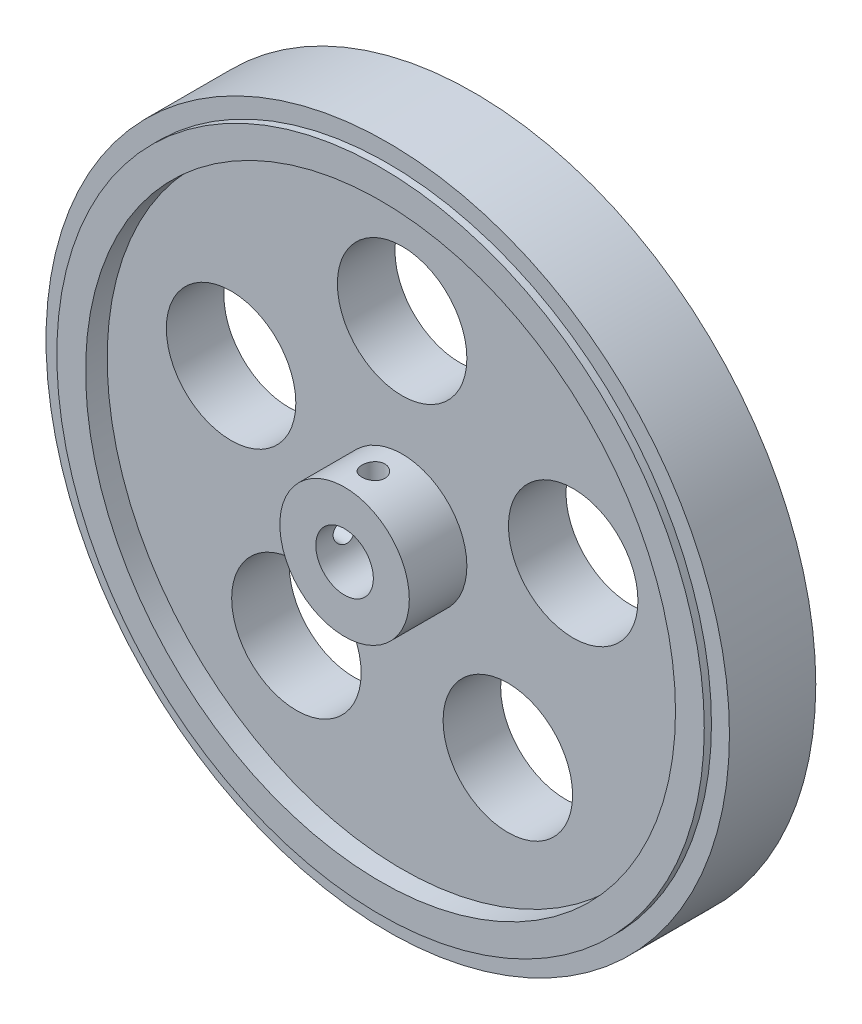
ISO-10303-21;
HEADER;
FILE_DESCRIPTION(('STEP AP214'),'2;1');
FILE_NAME('part.step','',(''),(''),'','','');
FILE_SCHEMA(('AUTOMOTIVE_DESIGN { 1 0 10303 214 1 1 1 1 }'));
ENDSEC;
DATA;
#1=APPLICATION_CONTEXT('core data for automotive mechanical design processes');
#2=APPLICATION_PROTOCOL_DEFINITION('international standard','automotive_design',2000,#1);
#3=PRODUCT_CONTEXT('',#1,'mechanical');
#4=PRODUCT('Part','Part','',(#3));
#5=PRODUCT_RELATED_PRODUCT_CATEGORY('part','',(#4));
#6=PRODUCT_DEFINITION_FORMATION('','',#4);
#7=PRODUCT_DEFINITION_CONTEXT('part definition',#1,'design');
#8=PRODUCT_DEFINITION('design','',#6,#7);
#9=PRODUCT_DEFINITION_SHAPE('','',#8);
#10=(LENGTH_UNIT() NAMED_UNIT(*) SI_UNIT(.MILLI.,.METRE.));
#11=(NAMED_UNIT(*) PLANE_ANGLE_UNIT() SI_UNIT($,.RADIAN.));
#12=(NAMED_UNIT(*) SI_UNIT($,.STERADIAN.) SOLID_ANGLE_UNIT());
#13=UNCERTAINTY_MEASURE_WITH_UNIT(LENGTH_MEASURE(1.E-05),#10,'distance_accuracy_value','');
#14=(GEOMETRIC_REPRESENTATION_CONTEXT(3) GLOBAL_UNCERTAINTY_ASSIGNED_CONTEXT((#13)) GLOBAL_UNIT_ASSIGNED_CONTEXT((#10,
#11,#12)) REPRESENTATION_CONTEXT('',''));
#15=CARTESIAN_POINT('',(0.,0.,0.));
#16=DIRECTION('',(0.,0.,1.));
#17=DIRECTION('',(1.,0.,0.));
#18=AXIS2_PLACEMENT_3D('',#15,#16,#17);
#19=CARTESIAN_POINT('',(0.,0.,-6.));
#20=DIRECTION('',(0.,0.,1.));
#21=DIRECTION('',(1.,0.,0.));
#22=AXIS2_PLACEMENT_3D('',#19,#20,#21);
#23=CYLINDRICAL_SURFACE('',#22,47.5);
#24=CARTESIAN_POINT('',(0.,0.,-6.));
#25=DIRECTION('',(0.,0.,1.));
#26=DIRECTION('',(1.,0.,0.));
#27=AXIS2_PLACEMENT_3D('',#24,#25,#26);
#28=CIRCLE('',#27,47.5);
#29=CARTESIAN_POINT('',(47.5,0.,-6.));
#30=VERTEX_POINT('',#29);
#31=EDGE_CURVE('E39',#30,#30,#28,.T.);
#32=ORIENTED_EDGE('',*,*,#31,.T.);
#33=EDGE_LOOP('',(#32));
#34=FACE_BOUND('',#33,.T.);
#35=CARTESIAN_POINT('',(0.,0.,6.));
#36=DIRECTION('',(0.,0.,1.));
#37=DIRECTION('',(1.,0.,0.));
#38=AXIS2_PLACEMENT_3D('',#35,#36,#37);
#39=CIRCLE('',#38,47.5);
#40=CARTESIAN_POINT('',(47.5,0.,6.));
#41=VERTEX_POINT('',#40);
#42=EDGE_CURVE('E55',#41,#41,#39,.T.);
#43=ORIENTED_EDGE('',*,*,#42,.F.);
#44=EDGE_LOOP('',(#43));
#45=FACE_BOUND('',#44,.T.);
#46=ADVANCED_FACE('F36',(#34,#45),#23,.T.);
#47=CARTESIAN_POINT('',(0.,0.,-6.));
#48=DIRECTION('',(0.,0.,1.));
#49=DIRECTION('',(1.,0.,0.));
#50=AXIS2_PLACEMENT_3D('',#47,#48,#49);
#51=PLANE('',#50);
#52=CARTESIAN_POINT('',(0.,0.,-6.));
#53=DIRECTION('',(0.,0.,-1.));
#54=DIRECTION('',(-1.,0.,0.));
#55=AXIS2_PLACEMENT_3D('',#52,#53,#54);
#56=CIRCLE('',#55,45.);
#57=CARTESIAN_POINT('',(-45.,0.,-6.));
#58=VERTEX_POINT('',#57);
#59=EDGE_CURVE('E10',#58,#58,#56,.T.);
#60=ORIENTED_EDGE('',*,*,#59,.F.);
#61=EDGE_LOOP('',(#60));
#62=FACE_BOUND('',#61,.T.);
#63=ORIENTED_EDGE('',*,*,#31,.F.);
#64=EDGE_LOOP('',(#63));
#65=FACE_BOUND('',#64,.T.);
#66=ADVANCED_FACE('F64',(#62,#65),#51,.F.);
#67=CARTESIAN_POINT('',(0.,0.,6.));
#68=DIRECTION('',(0.,0.,1.));
#69=DIRECTION('',(1.,0.,0.));
#70=AXIS2_PLACEMENT_3D('',#67,#68,#69);
#71=PLANE('',#70);
#72=CARTESIAN_POINT('',(0.,0.,6.));
#73=DIRECTION('',(0.,0.,1.));
#74=DIRECTION('',(1.,0.,0.));
#75=AXIS2_PLACEMENT_3D('',#72,#73,#74);
#76=CIRCLE('',#75,45.);
#77=CARTESIAN_POINT('',(45.,0.,6.));
#78=VERTEX_POINT('',#77);
#79=EDGE_CURVE('E43',#78,#78,#76,.T.);
#80=ORIENTED_EDGE('',*,*,#79,.F.);
#81=EDGE_LOOP('',(#80));
#82=FACE_BOUND('',#81,.T.);
#83=ORIENTED_EDGE('',*,*,#42,.T.);
#84=EDGE_LOOP('',(#83));
#85=FACE_BOUND('',#84,.T.);
#86=ADVANCED_FACE('F66',(#82,#85),#71,.T.);
#87=CARTESIAN_POINT('',(0.,0.,7.));
#88=DIRECTION('',(0.,0.,-1.));
#89=DIRECTION('',(-1.,0.,0.));
#90=AXIS2_PLACEMENT_3D('',#87,#88,#89);
#91=CYLINDRICAL_SURFACE('',#90,45.);
#92=CARTESIAN_POINT('',(0.,0.,7.));
#93=DIRECTION('',(0.,0.,1.));
#94=DIRECTION('',(1.,0.,0.));
#95=AXIS2_PLACEMENT_3D('',#92,#93,#94);
#96=CIRCLE('',#95,45.);
#97=CARTESIAN_POINT('',(45.,0.,7.));
#98=VERTEX_POINT('',#97);
#99=EDGE_CURVE('E53',#98,#98,#96,.T.);
#100=ORIENTED_EDGE('',*,*,#99,.F.);
#101=EDGE_LOOP('',(#100));
#102=FACE_BOUND('',#101,.T.);
#103=ORIENTED_EDGE('',*,*,#79,.T.);
#104=EDGE_LOOP('',(#103));
#105=FACE_BOUND('',#104,.T.);
#106=ADVANCED_FACE('F72',(#102,#105),#91,.T.);
#107=CARTESIAN_POINT('',(0.,0.,7.));
#108=DIRECTION('',(0.,0.,1.));
#109=DIRECTION('',(1.,0.,0.));
#110=AXIS2_PLACEMENT_3D('',#107,#108,#109);
#111=PLANE('',#110);
#112=CARTESIAN_POINT('',(0.,0.,7.));
#113=DIRECTION('',(0.,0.,1.));
#114=DIRECTION('',(1.,0.,0.));
#115=AXIS2_PLACEMENT_3D('',#112,#113,#114);
#116=CIRCLE('',#115,41.);
#117=CARTESIAN_POINT('',(41.,0.,7.));
#118=VERTEX_POINT('',#117);
#119=EDGE_CURVE('E205',#118,#118,#116,.T.);
#120=ORIENTED_EDGE('',*,*,#119,.F.);
#121=EDGE_LOOP('',(#120));
#122=FACE_BOUND('',#121,.T.);
#123=ORIENTED_EDGE('',*,*,#99,.T.);
#124=EDGE_LOOP('',(#123));
#125=FACE_BOUND('',#124,.T.);
#126=ADVANCED_FACE('F78',(#122,#125),#111,.T.);
#127=CARTESIAN_POINT('',(0.,0.,-7.));
#128=DIRECTION('',(0.,0.,1.));
#129=DIRECTION('',(1.,0.,0.));
#130=AXIS2_PLACEMENT_3D('',#127,#128,#129);
#131=CYLINDRICAL_SURFACE('',#130,45.);
#132=CARTESIAN_POINT('',(0.,0.,-7.));
#133=DIRECTION('',(0.,0.,-1.));
#134=DIRECTION('',(-1.,0.,0.));
#135=AXIS2_PLACEMENT_3D('',#132,#133,#134);
#136=CIRCLE('',#135,45.);
#137=CARTESIAN_POINT('',(-45.,0.,-7.));
#138=VERTEX_POINT('',#137);
#139=EDGE_CURVE('E51',#138,#138,#136,.T.);
#140=ORIENTED_EDGE('',*,*,#139,.F.);
#141=EDGE_LOOP('',(#140));
#142=FACE_BOUND('',#141,.T.);
#143=ORIENTED_EDGE('',*,*,#59,.T.);
#144=EDGE_LOOP('',(#143));
#145=FACE_BOUND('',#144,.T.);
#146=ADVANCED_FACE('F82',(#142,#145),#131,.T.);
#147=CARTESIAN_POINT('',(0.,0.,-7.));
#148=DIRECTION('',(0.,0.,-1.));
#149=DIRECTION('',(-1.,0.,0.));
#150=AXIS2_PLACEMENT_3D('',#147,#148,#149);
#151=PLANE('',#150);
#152=CARTESIAN_POINT('',(0.,0.,-7.));
#153=DIRECTION('',(0.,0.,-1.));
#154=DIRECTION('',(-1.,0.,0.));
#155=AXIS2_PLACEMENT_3D('',#152,#153,#154);
#156=CIRCLE('',#155,41.);
#157=CARTESIAN_POINT('',(-41.,0.,-7.));
#158=VERTEX_POINT('',#157);
#159=EDGE_CURVE('E212',#158,#158,#156,.T.);
#160=ORIENTED_EDGE('',*,*,#159,.F.);
#161=EDGE_LOOP('',(#160));
#162=FACE_BOUND('',#161,.T.);
#163=ORIENTED_EDGE('',*,*,#139,.T.);
#164=EDGE_LOOP('',(#163));
#165=FACE_BOUND('',#164,.T.);
#166=ADVANCED_FACE('F86',(#162,#165),#151,.T.);
#167=CARTESIAN_POINT('',(0.,0.,4.));
#168=DIRECTION('',(0.,0.,1.));
#169=DIRECTION('',(1.,0.,0.));
#170=AXIS2_PLACEMENT_3D('',#167,#168,#169);
#171=CYLINDRICAL_SURFACE('',#170,41.);
#172=CARTESIAN_POINT('',(0.,0.,4.));
#173=DIRECTION('',(0.,0.,1.));
#174=DIRECTION('',(1.,0.,0.));
#175=AXIS2_PLACEMENT_3D('',#172,#173,#174);
#176=CIRCLE('',#175,41.);
#177=CARTESIAN_POINT('',(41.,0.,4.));
#178=VERTEX_POINT('',#177);
#179=EDGE_CURVE('E209',#178,#178,#176,.T.);
#180=ORIENTED_EDGE('',*,*,#179,.F.);
#181=EDGE_LOOP('',(#180));
#182=FACE_BOUND('',#181,.T.);
#183=ORIENTED_EDGE('',*,*,#119,.T.);
#184=EDGE_LOOP('',(#183));
#185=FACE_BOUND('',#184,.T.);
#186=ADVANCED_FACE('F90',(#182,#185),#171,.F.);
#187=CARTESIAN_POINT('',(0.,0.,4.));
#188=DIRECTION('',(0.,0.,1.));
#189=DIRECTION('',(1.,0.,0.));
#190=AXIS2_PLACEMENT_3D('',#187,#188,#189);
#191=PLANE('',#190);
#192=CARTESIAN_POINT('',(23.7764129073788,7.72542485937368,4.));
#193=DIRECTION('',(0.,0.,1.));
#194=DIRECTION('',(1.,0.,0.));
#195=AXIS2_PLACEMENT_3D('',#192,#193,#194);
#196=CIRCLE('',#195,9.00000000000004);
#197=CARTESIAN_POINT('',(32.7764129073789,7.72542485937368,4.));
#198=VERTEX_POINT('',#197);
#199=EDGE_CURVE('E230',#198,#198,#196,.T.);
#200=ORIENTED_EDGE('',*,*,#199,.F.);
#201=EDGE_LOOP('',(#200));
#202=FACE_BOUND('',#201,.T.);
#203=CARTESIAN_POINT('',(14.6946313073118,-20.2254248593737,4.));
#204=DIRECTION('',(0.,0.,1.));
#205=DIRECTION('',(1.,0.,0.));
#206=AXIS2_PLACEMENT_3D('',#203,#204,#205);
#207=CIRCLE('',#206,9.00000000000009);
#208=CARTESIAN_POINT('',(23.6946313073119,-20.2254248593737,4.));
#209=VERTEX_POINT('',#208);
#210=EDGE_CURVE('E234',#209,#209,#207,.T.);
#211=ORIENTED_EDGE('',*,*,#210,.F.);
#212=EDGE_LOOP('',(#211));
#213=FACE_BOUND('',#212,.T.);
#214=CARTESIAN_POINT('',(-14.6946313073118,-20.2254248593737,4.));
#215=DIRECTION('',(0.,0.,1.));
#216=DIRECTION('',(1.,0.,0.));
#217=AXIS2_PLACEMENT_3D('',#214,#215,#216);
#218=CIRCLE('',#217,9.00000000000008);
#219=CARTESIAN_POINT('',(-5.69463130731175,-20.2254248593737,4.));
#220=VERTEX_POINT('',#219);
#221=EDGE_CURVE('E239',#220,#220,#218,.T.);
#222=ORIENTED_EDGE('',*,*,#221,.F.);
#223=EDGE_LOOP('',(#222));
#224=FACE_BOUND('',#223,.T.);
#225=CARTESIAN_POINT('',(-23.7764129073788,7.72542485937369,4.));
#226=DIRECTION('',(0.,0.,1.));
#227=DIRECTION('',(1.,0.,0.));
#228=AXIS2_PLACEMENT_3D('',#225,#226,#227);
#229=CIRCLE('',#228,9.00000000000001);
#230=CARTESIAN_POINT('',(-14.7764129073788,7.72542485937369,4.));
#231=VERTEX_POINT('',#230);
#232=EDGE_CURVE('E242',#231,#231,#229,.T.);
#233=ORIENTED_EDGE('',*,*,#232,.F.);
#234=EDGE_LOOP('',(#233));
#235=FACE_BOUND('',#234,.T.);
#236=CARTESIAN_POINT('',(0.,25.,4.));
#237=DIRECTION('',(0.,0.,1.));
#238=DIRECTION('',(1.,0.,0.));
#239=AXIS2_PLACEMENT_3D('',#236,#237,#238);
#240=CIRCLE('',#239,8.99999999999998);
#241=CARTESIAN_POINT('',(8.99999999999998,25.,4.));
#242=VERTEX_POINT('',#241);
#243=EDGE_CURVE('E245',#242,#242,#240,.T.);
#244=ORIENTED_EDGE('',*,*,#243,.F.);
#245=EDGE_LOOP('',(#244));
#246=FACE_BOUND('',#245,.T.);
#247=CARTESIAN_POINT('',(0.,0.,4.));
#248=DIRECTION('',(0.,0.,1.));
#249=DIRECTION('',(1.,0.,0.));
#250=AXIS2_PLACEMENT_3D('',#247,#248,#249);
#251=CIRCLE('',#250,9.);
#252=CARTESIAN_POINT('',(9.,0.,4.));
#253=VERTEX_POINT('',#252);
#254=EDGE_CURVE('E203',#253,#253,#251,.T.);
#255=ORIENTED_EDGE('',*,*,#254,.F.);
#256=EDGE_LOOP('',(#255));
#257=FACE_BOUND('',#256,.T.);
#258=ORIENTED_EDGE('',*,*,#179,.T.);
#259=EDGE_LOOP('',(#258));
#260=FACE_BOUND('',#259,.T.);
#261=ADVANCED_FACE('F110',(#202,#213,#224,#235,#246,#257,#260),#191,.T.);
#262=CARTESIAN_POINT('',(0.,0.,12.));
#263=DIRECTION('',(0.,0.,1.));
#264=DIRECTION('',(1.,0.,0.));
#265=AXIS2_PLACEMENT_3D('',#262,#263,#264);
#266=PLANE('',#265);
#267=CARTESIAN_POINT('',(0.,0.,12.));
#268=DIRECTION('',(0.,0.,1.));
#269=DIRECTION('',(1.,0.,0.));
#270=AXIS2_PLACEMENT_3D('',#267,#268,#269);
#271=CIRCLE('',#270,4.);
#272=CARTESIAN_POINT('',(4.,0.,12.));
#273=VERTEX_POINT('',#272);
#274=EDGE_CURVE('E264',#273,#273,#271,.T.);
#275=ORIENTED_EDGE('',*,*,#274,.F.);
#276=EDGE_LOOP('',(#275));
#277=FACE_BOUND('',#276,.T.);
#278=CARTESIAN_POINT('',(0.,0.,12.));
#279=DIRECTION('',(0.,0.,1.));
#280=DIRECTION('',(1.,0.,0.));
#281=AXIS2_PLACEMENT_3D('',#278,#279,#280);
#282=CIRCLE('',#281,9.);
#283=CARTESIAN_POINT('',(9.,0.,12.));
#284=VERTEX_POINT('',#283);
#285=EDGE_CURVE('E200',#284,#284,#282,.T.);
#286=ORIENTED_EDGE('',*,*,#285,.T.);
#287=EDGE_LOOP('',(#286));
#288=FACE_BOUND('',#287,.T.);
#289=ADVANCED_FACE('F106',(#277,#288),#266,.T.);
#290=CARTESIAN_POINT('',(0.,0.,12.));
#291=DIRECTION('',(0.,0.,-1.));
#292=DIRECTION('',(-1.,0.,0.));
#293=AXIS2_PLACEMENT_3D('',#290,#291,#292);
#294=CYLINDRICAL_SURFACE('',#293,9.);
#295=CARTESIAN_POINT('',(0.,9.,9.6));
#296=CARTESIAN_POINT('',(0.0891199889022123,8.99999842101241,9.59999650999753));
#297=CARTESIAN_POINT('',(0.178286373811932,8.99866254538546,9.59252886703613));
#298=CARTESIAN_POINT('',(0.354112162977067,8.99346217162353,9.56287155401015));
#299=CARTESIAN_POINT('',(0.440769290112072,8.98959544750788,9.540668923705));
#300=CARTESIAN_POINT('',(0.609007816682141,8.97976647847911,9.48223829206875));
#301=CARTESIAN_POINT('',(0.690593523221338,8.97380604116375,9.44602238630523));
#302=CARTESIAN_POINT('',(0.846521639833109,8.9604426739079,9.36062632259557));
#303=CARTESIAN_POINT('',(0.920864750907525,8.95303988377943,9.31144742103254));
#304=CARTESIAN_POINT('',(1.06101042913895,8.93752107386243,9.20095610959205));
#305=CARTESIAN_POINT('',(1.12672329975455,8.92939884036114,9.13953079061428));
#306=CARTESIAN_POINT('',(1.24696773358254,8.91340337467269,9.0065332527793));
#307=CARTESIAN_POINT('',(1.30149854179097,8.90553015932936,8.9349603493167));
#308=CARTESIAN_POINT('',(1.39819750156619,8.89086390002565,8.78307389304275));
#309=CARTESIAN_POINT('',(1.44027562556876,8.88407887715324,8.7027021815132));
#310=CARTESIAN_POINT('',(1.51029875147196,8.87244417371761,8.53589010241383));
#311=CARTESIAN_POINT('',(1.53824484413461,8.86759434379518,8.44945020379562));
#312=CARTESIAN_POINT('',(1.57892525274373,8.86044137771626,8.27391103529108));
#313=CARTESIAN_POINT('',(1.59181525903408,8.85811219515826,8.18484892785442));
#314=CARTESIAN_POINT('',(1.60250059457246,8.85618559649113,8.0057979383732));
#315=CARTESIAN_POINT('',(1.60029713955403,8.85658796036402,7.91580913155451));
#316=CARTESIAN_POINT('',(1.5809846181553,8.86005524545088,7.73857914392946));
#317=CARTESIAN_POINT('',(1.56405155315557,8.86308872669843,7.65131807918593));
#318=CARTESIAN_POINT('',(1.51603718898619,8.87142714923806,7.48089546055713));
#319=CARTESIAN_POINT('',(1.48495534402251,8.87673217815541,7.39773406495518));
#320=CARTESIAN_POINT('',(1.40935057289568,8.88904934759434,7.23735073761909));
#321=CARTESIAN_POINT('',(1.36475561236361,8.89607059700136,7.1601634912911));
#322=CARTESIAN_POINT('',(1.26344153576323,8.91102292647752,7.01430103908486));
#323=CARTESIAN_POINT('',(1.2067213099282,8.91895408979587,6.94562661325334));
#324=CARTESIAN_POINT('',(1.08181303730033,8.93497015847767,6.81772140413576));
#325=CARTESIAN_POINT('',(1.01347422269308,8.94305565233282,6.75863783095746));
#326=CARTESIAN_POINT('',(0.867775747328104,8.95836603849457,6.65275278362007));
#327=CARTESIAN_POINT('',(0.790416012610209,8.96559092374428,6.60595141016978));
#328=CARTESIAN_POINT('',(0.628725387252163,8.97837847205809,6.52594160196901));
#329=CARTESIAN_POINT('',(0.544387323694019,8.9839393969741,6.4927473677391));
#330=CARTESIAN_POINT('',(0.371211899336645,8.99275880001199,6.44103703919972));
#331=CARTESIAN_POINT('',(0.28237496838026,8.9960174976563,6.42251954541019));
#332=CARTESIAN_POINT('',(0.103991168574758,8.99983543164877,6.40089067226623));
#333=CARTESIAN_POINT('',(0.014469509682857,9.00043003979579,6.39757740804007));
#334=CARTESIAN_POINT('',(-0.163849121698735,8.99895010874175,6.40591109791396));
#335=CARTESIAN_POINT('',(-0.252646125889518,8.9968756869381,6.41755739401701));
#336=CARTESIAN_POINT('',(-0.426362531500534,8.99031274069892,6.45531171482474));
#337=CARTESIAN_POINT('',(-0.511304597461475,8.98584109846802,6.48131864407655));
#338=CARTESIAN_POINT('',(-0.675623007789177,8.97498301575709,6.54694737387567));
#339=CARTESIAN_POINT('',(-0.754999004457336,8.96859645578812,6.5865700240528));
#340=CARTESIAN_POINT('',(-0.90680107105383,8.95452886378439,6.67875974307018));
#341=CARTESIAN_POINT('',(-0.97915026454899,8.94683560234911,6.73145149546752));
#342=CARTESIAN_POINT('',(-1.11405184565034,8.93104192631922,6.84811364152417));
#343=CARTESIAN_POINT('',(-1.17660341600601,8.9229414778342,6.9120849751037));
#344=CARTESIAN_POINT('',(-1.29089228646818,8.9071304689102,7.05040034951394));
#345=CARTESIAN_POINT('',(-1.34249245590756,8.89942567549632,7.12485846643002));
#346=CARTESIAN_POINT('',(-1.4324527450687,8.88539029596841,7.28150445705407));
#347=CARTESIAN_POINT('',(-1.47081332418193,8.87905966217619,7.36369206243588));
#348=CARTESIAN_POINT('',(-1.53300592917691,8.8685336915973,7.53309895021014));
#349=CARTESIAN_POINT('',(-1.55690340007955,8.86432875059592,7.6202935822484));
#350=CARTESIAN_POINT('',(-1.5896953542958,8.85850726118019,7.79754125276742));
#351=CARTESIAN_POINT('',(-1.59859134138627,8.85689045332734,7.88759400382285));
#352=CARTESIAN_POINT('',(-1.60108148470831,8.85644051064373,8.0666301769728));
#353=CARTESIAN_POINT('',(-1.59489171371261,8.85756806805314,8.15561056775652));
#354=CARTESIAN_POINT('',(-1.56785629660067,8.86239313508238,8.33124158974503));
#355=CARTESIAN_POINT('',(-1.54701071784785,8.86609063288983,8.4178922316563));
#356=CARTESIAN_POINT('',(-1.4913426083545,8.87562318192817,8.58630350608332));
#357=CARTESIAN_POINT('',(-1.45654117989918,8.88145500474261,8.66807130831137));
#358=CARTESIAN_POINT('',(-1.37397214829578,8.89460176575639,8.82464242816941));
#359=CARTESIAN_POINT('',(-1.32620375866526,8.90191679390947,8.89944532298858));
#360=CARTESIAN_POINT('',(-1.21829594749923,8.91732902502244,9.04105014594484));
#361=CARTESIAN_POINT('',(-1.1579984307139,8.92543544320789,9.10773061615621));
#362=CARTESIAN_POINT('',(-1.02707564037896,8.94144596625312,9.23009985331686));
#363=CARTESIAN_POINT('',(-0.956447994090279,8.94935002414111,9.28578608806405));
#364=CARTESIAN_POINT('',(-0.806197276783407,8.96413880199544,9.38499697811787));
#365=CARTESIAN_POINT('',(-0.726506966982223,8.97101489116936,9.42842111602936));
#366=CARTESIAN_POINT('',(-0.560868965742403,8.98288895349221,9.50119715800776));
#367=CARTESIAN_POINT('',(-0.474927416325986,8.98788874118243,9.53056266557114));
#368=CARTESIAN_POINT('',(-0.323910705887374,8.99439282129417,9.5682264303516));
#369=CARTESIAN_POINT('',(-0.259733829734236,8.99648394692915,9.58012177954452));
#370=CARTESIAN_POINT('',(-0.130379566355957,8.9992880992576,9.59600975712086));
#371=CARTESIAN_POINT('',(-0.0652022004121546,9.00000115522305,9.60000255336478));
#372=CARTESIAN_POINT('',(0.,9.,9.6));
#373=B_SPLINE_CURVE_WITH_KNOTS('',3,(#295,#296,#297,#298,#299,#300,#301,#302,#303,#304,#305,
#306,#307,#308,#309,#310,#311,#312,#313,#314,#315,#316,#317,#318,#319,#320,#321,#322,#323,#324,
#325,#326,#327,#328,#329,#330,#331,#332,#333,#334,#335,#336,#337,#338,#339,#340,#341,#342,#343,
#344,#345,#346,#347,#348,#349,#350,#351,#352,#353,#354,#355,#356,#357,#358,#359,#360,#361,#362,
#363,#364,#365,#366,#367,#368,#369,#370,#371,#372),.UNSPECIFIED.,.T.,.F.,(4,2,2,2,2,2,2,2,2,2,2,
2,2,2,2,2,2,2,2,2,2,2,2,2,2,2,2,2,2,2,2,2,2,2,2,2,2,2,4),(0.,0.26712157461523,0.534478409438381,
0.801604987979056,1.06870568592856,1.33839346950073,1.60809945618666,1.87971016674491,
2.15129991019101,2.42005564284313,2.68878972827276,2.95435619462343,3.21993290615981,
3.48695100494025,3.75399355306365,4.02481082247453,4.29563031240196,4.5667317165881,
4.8378072671677,5.10527280313427,5.37272657501887,5.63832110619031,5.90393221364347,
6.17218198568697,6.44045412138395,6.71190959939084,6.98335565740308,7.25356406549827,
7.52374538578562,7.7900797081413,8.05641280633542,8.32234469843295,8.58829272364878,
8.85782605825659,9.12742139978661,9.39916649807141,9.67064811458915,9.86608445414369,
10.0615166423319),.UNSPECIFIED.);
#374=CARTESIAN_POINT('',(0.,9.,9.6));
#375=VERTEX_POINT('',#374);
#376=EDGE_CURVE('E169',#375,#375,#373,.T.);
#377=ORIENTED_EDGE('',*,*,#376,.F.);
#378=EDGE_LOOP('',(#377));
#379=FACE_BOUND('',#378,.T.);
#380=CARTESIAN_POINT('',(-9.,0.,9.6));
#381=CARTESIAN_POINT('',(-8.99999842101241,0.0891199889022124,9.59999650999753));
#382=CARTESIAN_POINT('',(-8.99866254538546,0.178286373811932,9.59252886703613));
#383=CARTESIAN_POINT('',(-8.99346217162353,0.354112162977067,9.56287155401015));
#384=CARTESIAN_POINT('',(-8.98959544750788,0.440769290112072,9.54066892370501));
#385=CARTESIAN_POINT('',(-8.97976647847911,0.609007816682141,9.48223829206875));
#386=CARTESIAN_POINT('',(-8.97380604116375,0.690593523221337,9.44602238630523));
#387=CARTESIAN_POINT('',(-8.9604426739079,0.846521639833109,9.36062632259557));
#388=CARTESIAN_POINT('',(-8.95303988377943,0.920864750907525,9.31144742103254));
#389=CARTESIAN_POINT('',(-8.93752107386243,1.06101042913895,9.20095610959205));
#390=CARTESIAN_POINT('',(-8.92939884036114,1.12672329975455,9.13953079061428));
#391=CARTESIAN_POINT('',(-8.91340337467269,1.24696773358254,9.0065332527793));
#392=CARTESIAN_POINT('',(-8.90553015932936,1.30149854179097,8.9349603493167));
#393=CARTESIAN_POINT('',(-8.89086390002565,1.39819750156619,8.78307389304275));
#394=CARTESIAN_POINT('',(-8.88407887715324,1.44027562556877,8.7027021815132));
#395=CARTESIAN_POINT('',(-8.87244417371761,1.51029875147196,8.53589010241383));
#396=CARTESIAN_POINT('',(-8.86759434379518,1.53824484413461,8.44945020379562));
#397=CARTESIAN_POINT('',(-8.86044137771626,1.57892525274373,8.27391103529108));
#398=CARTESIAN_POINT('',(-8.85811219515826,1.59181525903408,8.18484892785442));
#399=CARTESIAN_POINT('',(-8.85618559649113,1.60250059457246,8.0057979383732));
#400=CARTESIAN_POINT('',(-8.85658796036402,1.60029713955403,7.91580913155451));
#401=CARTESIAN_POINT('',(-8.86005524545088,1.5809846181553,7.73857914392947));
#402=CARTESIAN_POINT('',(-8.86308872669843,1.56405155315557,7.65131807918593));
#403=CARTESIAN_POINT('',(-8.87142714923806,1.51603718898619,7.48089546055713));
#404=CARTESIAN_POINT('',(-8.87673217815541,1.48495534402251,7.39773406495518));
#405=CARTESIAN_POINT('',(-8.88904934759434,1.40935057289568,7.23735073761909));
#406=CARTESIAN_POINT('',(-8.89607059700136,1.36475561236361,7.1601634912911));
#407=CARTESIAN_POINT('',(-8.91102292647752,1.26344153576323,7.01430103908486));
#408=CARTESIAN_POINT('',(-8.91895408979587,1.2067213099282,6.94562661325334));
#409=CARTESIAN_POINT('',(-8.93497015847767,1.08181303730034,6.81772140413576));
#410=CARTESIAN_POINT('',(-8.94305565233282,1.01347422269308,6.75863783095746));
#411=CARTESIAN_POINT('',(-8.95836603849457,0.867775747328105,6.65275278362007));
#412=CARTESIAN_POINT('',(-8.96559092374428,0.79041601261021,6.60595141016978));
#413=CARTESIAN_POINT('',(-8.97837847205809,0.628725387252162,6.52594160196901));
#414=CARTESIAN_POINT('',(-8.9839393969741,0.544387323694019,6.4927473677391));
#415=CARTESIAN_POINT('',(-8.99275880001199,0.371211899336645,6.44103703919972));
#416=CARTESIAN_POINT('',(-8.9960174976563,0.28237496838026,6.42251954541019));
#417=CARTESIAN_POINT('',(-8.99983543164877,0.103991168574758,6.40089067226623));
#418=CARTESIAN_POINT('',(-9.00043003979579,0.0144695096828569,6.39757740804007));
#419=CARTESIAN_POINT('',(-8.99895010874175,-0.163849121698735,6.40591109791396));
#420=CARTESIAN_POINT('',(-8.9968756869381,-0.252646125889518,6.41755739401701));
#421=CARTESIAN_POINT('',(-8.99031274069892,-0.426362531500533,6.45531171482474));
#422=CARTESIAN_POINT('',(-8.98584109846802,-0.511304597461475,6.48131864407655));
#423=CARTESIAN_POINT('',(-8.97498301575709,-0.675623007789176,6.54694737387567));
#424=CARTESIAN_POINT('',(-8.96859645578812,-0.754999004457336,6.5865700240528));
#425=CARTESIAN_POINT('',(-8.95452886378439,-0.906801071053829,6.67875974307018));
#426=CARTESIAN_POINT('',(-8.94683560234911,-0.97915026454899,6.73145149546752));
#427=CARTESIAN_POINT('',(-8.93104192631921,-1.11405184565034,6.84811364152417));
#428=CARTESIAN_POINT('',(-8.9229414778342,-1.17660341600601,6.9120849751037));
#429=CARTESIAN_POINT('',(-8.9071304689102,-1.29089228646818,7.05040034951394));
#430=CARTESIAN_POINT('',(-8.89942567549632,-1.34249245590756,7.12485846643002));
#431=CARTESIAN_POINT('',(-8.88539029596841,-1.4324527450687,7.28150445705406));
#432=CARTESIAN_POINT('',(-8.87905966217619,-1.47081332418193,7.36369206243587));
#433=CARTESIAN_POINT('',(-8.8685336915973,-1.53300592917691,7.53309895021014));
#434=CARTESIAN_POINT('',(-8.86432875059592,-1.55690340007955,7.6202935822484));
#435=CARTESIAN_POINT('',(-8.85850726118019,-1.5896953542958,7.79754125276742));
#436=CARTESIAN_POINT('',(-8.85689045332734,-1.59859134138627,7.88759400382285));
#437=CARTESIAN_POINT('',(-8.85644051064373,-1.60108148470831,8.0666301769728));
#438=CARTESIAN_POINT('',(-8.85756806805314,-1.59489171371261,8.15561056775652));
#439=CARTESIAN_POINT('',(-8.86239313508238,-1.56785629660067,8.33124158974503));
#440=CARTESIAN_POINT('',(-8.86609063288983,-1.54701071784785,8.4178922316563));
#441=CARTESIAN_POINT('',(-8.87562318192817,-1.4913426083545,8.58630350608332));
#442=CARTESIAN_POINT('',(-8.88145500474261,-1.45654117989918,8.66807130831137));
#443=CARTESIAN_POINT('',(-8.89460176575639,-1.37397214829578,8.82464242816941));
#444=CARTESIAN_POINT('',(-8.90191679390947,-1.32620375866526,8.89944532298858));
#445=CARTESIAN_POINT('',(-8.91732902502243,-1.21829594749924,9.04105014594484));
#446=CARTESIAN_POINT('',(-8.92543544320789,-1.1579984307139,9.1077306161562));
#447=CARTESIAN_POINT('',(-8.94144596625312,-1.02707564037896,9.23009985331686));
#448=CARTESIAN_POINT('',(-8.94935002414111,-0.956447994090281,9.28578608806405));
#449=CARTESIAN_POINT('',(-8.96413880199544,-0.806197276783408,9.38499697811787));
#450=CARTESIAN_POINT('',(-8.97101489116936,-0.726506966982224,9.42842111602936));
#451=CARTESIAN_POINT('',(-8.98288895349221,-0.560868965742404,9.50119715800776));
#452=CARTESIAN_POINT('',(-8.98788874118243,-0.474927416325987,9.53056266557114));
#453=CARTESIAN_POINT('',(-8.99439282129417,-0.323910705887375,9.5682264303516));
#454=CARTESIAN_POINT('',(-8.99648394692915,-0.259733829734237,9.58012177954452));
#455=CARTESIAN_POINT('',(-8.9992880992576,-0.130379566355957,9.59600975712086));
#456=CARTESIAN_POINT('',(-9.00000115522305,-0.0652022004121551,9.60000255336478));
#457=CARTESIAN_POINT('',(-9.,0.,9.6));
#458=B_SPLINE_CURVE_WITH_KNOTS('',3,(#380,#381,#382,#383,#384,#385,#386,#387,#388,#389,#390,
#391,#392,#393,#394,#395,#396,#397,#398,#399,#400,#401,#402,#403,#404,#405,#406,#407,#408,#409,
#410,#411,#412,#413,#414,#415,#416,#417,#418,#419,#420,#421,#422,#423,#424,#425,#426,#427,#428,
#429,#430,#431,#432,#433,#434,#435,#436,#437,#438,#439,#440,#441,#442,#443,#444,#445,#446,#447,
#448,#449,#450,#451,#452,#453,#454,#455,#456,#457),.UNSPECIFIED.,.T.,.F.,(4,2,2,2,2,2,2,2,2,2,2,
2,2,2,2,2,2,2,2,2,2,2,2,2,2,2,2,2,2,2,2,2,2,2,2,2,2,2,4),(0.,0.267121574615231,
0.534478409438381,0.801604987979056,1.06870568592856,1.33839346950073,1.60809945618666,
1.87971016674491,2.15129991019101,2.42005564284313,2.68878972827276,2.95435619462343,
3.21993290615981,3.48695100494025,3.75399355306365,4.02481082247453,4.29563031240196,
4.5667317165881,4.8378072671677,5.10527280313427,5.37272657501887,5.63832110619031,
5.90393221364347,6.17218198568697,6.44045412138396,6.71190959939084,6.98335565740308,
7.25356406549827,7.52374538578563,7.7900797081413,8.05641280633543,8.32234469843295,
8.58829272364878,8.85782605825659,9.12742139978661,9.39916649807141,9.67064811458915,
9.86608445414369,10.0615166423319),.UNSPECIFIED.);
#459=CARTESIAN_POINT('',(-9.,0.,9.6));
#460=VERTEX_POINT('',#459);
#461=EDGE_CURVE('E157',#460,#460,#458,.T.);
#462=ORIENTED_EDGE('',*,*,#461,.F.);
#463=EDGE_LOOP('',(#462));
#464=FACE_BOUND('',#463,.T.);
#465=ORIENTED_EDGE('',*,*,#285,.F.);
#466=EDGE_LOOP('',(#465));
#467=FACE_BOUND('',#466,.T.);
#468=ORIENTED_EDGE('',*,*,#254,.T.);
#469=EDGE_LOOP('',(#468));
#470=FACE_BOUND('',#469,.T.);
#471=ADVANCED_FACE('F102',(#379,#464,#467,#470),#294,.T.);
#472=CARTESIAN_POINT('',(0.,0.,-4.));
#473=DIRECTION('',(0.,0.,-1.));
#474=DIRECTION('',(-1.,0.,0.));
#475=AXIS2_PLACEMENT_3D('',#472,#473,#474);
#476=CYLINDRICAL_SURFACE('',#475,41.);
#477=CARTESIAN_POINT('',(0.,0.,-4.));
#478=DIRECTION('',(0.,0.,-1.));
#479=DIRECTION('',(-1.,0.,0.));
#480=AXIS2_PLACEMENT_3D('',#477,#478,#479);
#481=CIRCLE('',#480,41.);
#482=CARTESIAN_POINT('',(-41.,0.,-4.));
#483=VERTEX_POINT('',#482);
#484=EDGE_CURVE('E206',#483,#483,#481,.T.);
#485=ORIENTED_EDGE('',*,*,#484,.F.);
#486=EDGE_LOOP('',(#485));
#487=FACE_BOUND('',#486,.T.);
#488=ORIENTED_EDGE('',*,*,#159,.T.);
#489=EDGE_LOOP('',(#488));
#490=FACE_BOUND('',#489,.T.);
#491=ADVANCED_FACE('F105',(#487,#490),#476,.F.);
#492=CARTESIAN_POINT('',(0.,0.,-4.));
#493=DIRECTION('',(0.,0.,-1.));
#494=DIRECTION('',(-1.,0.,0.));
#495=AXIS2_PLACEMENT_3D('',#492,#493,#494);
#496=PLANE('',#495);
#497=CARTESIAN_POINT('',(23.7764129073788,7.72542485937368,-4.));
#498=DIRECTION('',(0.,0.,-1.));
#499=DIRECTION('',(-1.,0.,0.));
#500=AXIS2_PLACEMENT_3D('',#497,#498,#499);
#501=CIRCLE('',#500,9.00000000000004);
#502=CARTESIAN_POINT('',(14.7764129073788,7.72542485937368,-4.));
#503=VERTEX_POINT('',#502);
#504=EDGE_CURVE('E252',#503,#503,#501,.T.);
#505=ORIENTED_EDGE('',*,*,#504,.F.);
#506=EDGE_LOOP('',(#505));
#507=FACE_BOUND('',#506,.T.);
#508=CARTESIAN_POINT('',(14.6946313073118,-20.2254248593737,-4.));
#509=DIRECTION('',(0.,0.,-1.));
#510=DIRECTION('',(-1.,0.,0.));
#511=AXIS2_PLACEMENT_3D('',#508,#509,#510);
#512=CIRCLE('',#511,9.00000000000009);
#513=CARTESIAN_POINT('',(5.69463130731174,-20.2254248593737,-4.));
#514=VERTEX_POINT('',#513);
#515=EDGE_CURVE('E255',#514,#514,#512,.T.);
#516=ORIENTED_EDGE('',*,*,#515,.F.);
#517=EDGE_LOOP('',(#516));
#518=FACE_BOUND('',#517,.T.);
#519=CARTESIAN_POINT('',(-14.6946313073118,-20.2254248593737,-4.));
#520=DIRECTION('',(0.,0.,-1.));
#521=DIRECTION('',(-1.,0.,0.));
#522=AXIS2_PLACEMENT_3D('',#519,#520,#521);
#523=CIRCLE('',#522,9.00000000000008);
#524=CARTESIAN_POINT('',(-23.6946313073119,-20.2254248593737,-4.));
#525=VERTEX_POINT('',#524);
#526=EDGE_CURVE('E259',#525,#525,#523,.T.);
#527=ORIENTED_EDGE('',*,*,#526,.F.);
#528=EDGE_LOOP('',(#527));
#529=FACE_BOUND('',#528,.T.);
#530=CARTESIAN_POINT('',(-23.7764129073788,7.72542485937369,-4.));
#531=DIRECTION('',(0.,0.,-1.));
#532=DIRECTION('',(-1.,0.,0.));
#533=AXIS2_PLACEMENT_3D('',#530,#531,#532);
#534=CIRCLE('',#533,9.00000000000001);
#535=CARTESIAN_POINT('',(-32.7764129073788,7.72542485937369,-4.));
#536=VERTEX_POINT('',#535);
#537=EDGE_CURVE('E251',#536,#536,#534,.T.);
#538=ORIENTED_EDGE('',*,*,#537,.F.);
#539=EDGE_LOOP('',(#538));
#540=FACE_BOUND('',#539,.T.);
#541=CARTESIAN_POINT('',(0.,25.,-4.));
#542=DIRECTION('',(0.,0.,-1.));
#543=DIRECTION('',(-1.,0.,0.));
#544=AXIS2_PLACEMENT_3D('',#541,#542,#543);
#545=CIRCLE('',#544,8.99999999999998);
#546=CARTESIAN_POINT('',(-8.99999999999998,25.,-4.));
#547=VERTEX_POINT('',#546);
#548=EDGE_CURVE('E248',#547,#547,#545,.T.);
#549=ORIENTED_EDGE('',*,*,#548,.F.);
#550=EDGE_LOOP('',(#549));
#551=FACE_BOUND('',#550,.T.);
#552=CARTESIAN_POINT('',(0.,0.,-4.));
#553=DIRECTION('',(0.,0.,-1.));
#554=DIRECTION('',(-1.,0.,0.));
#555=AXIS2_PLACEMENT_3D('',#552,#553,#554);
#556=CIRCLE('',#555,9.);
#557=CARTESIAN_POINT('',(-9.,0.,-4.));
#558=VERTEX_POINT('',#557);
#559=EDGE_CURVE('E228',#558,#558,#556,.T.);
#560=ORIENTED_EDGE('',*,*,#559,.F.);
#561=EDGE_LOOP('',(#560));
#562=FACE_BOUND('',#561,.T.);
#563=ORIENTED_EDGE('',*,*,#484,.T.);
#564=EDGE_LOOP('',(#563));
#565=FACE_BOUND('',#564,.T.);
#566=ADVANCED_FACE('F100',(#507,#518,#529,#540,#551,#562,#565),#496,.T.);
#567=CARTESIAN_POINT('',(0.,0.,-7.2));
#568=DIRECTION('',(0.,0.,-1.));
#569=DIRECTION('',(-1.,0.,0.));
#570=AXIS2_PLACEMENT_3D('',#567,#568,#569);
#571=PLANE('',#570);
#572=CARTESIAN_POINT('',(0.,0.,-7.2));
#573=DIRECTION('',(0.,0.,1.));
#574=DIRECTION('',(1.,0.,0.));
#575=AXIS2_PLACEMENT_3D('',#572,#573,#574);
#576=CIRCLE('',#575,4.);
#577=CARTESIAN_POINT('',(4.,0.,-7.2));
#578=VERTEX_POINT('',#577);
#579=EDGE_CURVE('E256',#578,#578,#576,.T.);
#580=ORIENTED_EDGE('',*,*,#579,.T.);
#581=EDGE_LOOP('',(#580));
#582=FACE_BOUND('',#581,.T.);
#583=CARTESIAN_POINT('',(0.,0.,-7.2));
#584=DIRECTION('',(0.,0.,-1.));
#585=DIRECTION('',(-1.,0.,0.));
#586=AXIS2_PLACEMENT_3D('',#583,#584,#585);
#587=CIRCLE('',#586,9.);
#588=CARTESIAN_POINT('',(-9.,0.,-7.2));
#589=VERTEX_POINT('',#588);
#590=EDGE_CURVE('E218',#589,#589,#587,.T.);
#591=ORIENTED_EDGE('',*,*,#590,.T.);
#592=EDGE_LOOP('',(#591));
#593=FACE_BOUND('',#592,.T.);
#594=ADVANCED_FACE('F96',(#582,#593),#571,.T.);
#595=CARTESIAN_POINT('',(0.,0.,-7.2));
#596=DIRECTION('',(0.,0.,1.));
#597=DIRECTION('',(1.,0.,0.));
#598=AXIS2_PLACEMENT_3D('',#595,#596,#597);
#599=CYLINDRICAL_SURFACE('',#598,9.);
#600=ORIENTED_EDGE('',*,*,#590,.F.);
#601=EDGE_LOOP('',(#600));
#602=FACE_BOUND('',#601,.T.);
#603=ORIENTED_EDGE('',*,*,#559,.T.);
#604=EDGE_LOOP('',(#603));
#605=FACE_BOUND('',#604,.T.);
#606=ADVANCED_FACE('F92',(#602,#605),#599,.T.);
#607=CARTESIAN_POINT('',(0.,25.,12.));
#608=DIRECTION('',(0.,0.,-1.));
#609=DIRECTION('',(-1.,0.,0.));
#610=AXIS2_PLACEMENT_3D('',#607,#608,#609);
#611=CYLINDRICAL_SURFACE('',#610,8.99999999999998);
#612=ORIENTED_EDGE('',*,*,#243,.T.);
#613=EDGE_LOOP('',(#612));
#614=FACE_BOUND('',#613,.T.);
#615=ORIENTED_EDGE('',*,*,#548,.T.);
#616=EDGE_LOOP('',(#615));
#617=FACE_BOUND('',#616,.T.);
#618=ADVANCED_FACE('F95',(#614,#617),#611,.F.);
#619=CARTESIAN_POINT('',(-23.7764129073788,7.72542485937369,12.));
#620=DIRECTION('',(0.,0.,-1.));
#621=DIRECTION('',(-1.,0.,0.));
#622=AXIS2_PLACEMENT_3D('',#619,#620,#621);
#623=CYLINDRICAL_SURFACE('',#622,9.00000000000001);
#624=ORIENTED_EDGE('',*,*,#232,.T.);
#625=EDGE_LOOP('',(#624));
#626=FACE_BOUND('',#625,.T.);
#627=ORIENTED_EDGE('',*,*,#537,.T.);
#628=EDGE_LOOP('',(#627));
#629=FACE_BOUND('',#628,.T.);
#630=ADVANCED_FACE('F126',(#626,#629),#623,.F.);
#631=CARTESIAN_POINT('',(-14.6946313073118,-20.2254248593737,12.));
#632=DIRECTION('',(0.,0.,-1.));
#633=DIRECTION('',(-1.,0.,0.));
#634=AXIS2_PLACEMENT_3D('',#631,#632,#633);
#635=CYLINDRICAL_SURFACE('',#634,9.00000000000008);
#636=ORIENTED_EDGE('',*,*,#221,.T.);
#637=EDGE_LOOP('',(#636));
#638=FACE_BOUND('',#637,.T.);
#639=ORIENTED_EDGE('',*,*,#526,.T.);
#640=EDGE_LOOP('',(#639));
#641=FACE_BOUND('',#640,.T.);
#642=ADVANCED_FACE('F136',(#638,#641),#635,.F.);
#643=CARTESIAN_POINT('',(14.6946313073118,-20.2254248593737,12.));
#644=DIRECTION('',(0.,0.,-1.));
#645=DIRECTION('',(-1.,0.,0.));
#646=AXIS2_PLACEMENT_3D('',#643,#644,#645);
#647=CYLINDRICAL_SURFACE('',#646,9.00000000000009);
#648=ORIENTED_EDGE('',*,*,#210,.T.);
#649=EDGE_LOOP('',(#648));
#650=FACE_BOUND('',#649,.T.);
#651=ORIENTED_EDGE('',*,*,#515,.T.);
#652=EDGE_LOOP('',(#651));
#653=FACE_BOUND('',#652,.T.);
#654=ADVANCED_FACE('F132',(#650,#653),#647,.F.);
#655=CARTESIAN_POINT('',(23.7764129073788,7.72542485937368,12.));
#656=DIRECTION('',(0.,0.,-1.));
#657=DIRECTION('',(-1.,0.,0.));
#658=AXIS2_PLACEMENT_3D('',#655,#656,#657);
#659=CYLINDRICAL_SURFACE('',#658,9.00000000000004);
#660=ORIENTED_EDGE('',*,*,#199,.T.);
#661=EDGE_LOOP('',(#660));
#662=FACE_BOUND('',#661,.T.);
#663=ORIENTED_EDGE('',*,*,#504,.T.);
#664=EDGE_LOOP('',(#663));
#665=FACE_BOUND('',#664,.T.);
#666=ADVANCED_FACE('F128',(#662,#665),#659,.F.);
#667=CARTESIAN_POINT('',(0.,0.,-7.2));
#668=DIRECTION('',(0.,0.,1.));
#669=DIRECTION('',(1.,0.,0.));
#670=AXIS2_PLACEMENT_3D('',#667,#668,#669);
#671=CYLINDRICAL_SURFACE('',#670,4.);
#672=CARTESIAN_POINT('',(0.,4.,9.6));
#673=CARTESIAN_POINT('',(-0.0859944043543132,3.99999416981668,9.59999211854102));
#674=CARTESIAN_POINT('',(-0.172138051272539,3.99719435445546,9.5930257983293));
#675=CARTESIAN_POINT('',(-0.341997184334317,3.98626762480513,9.56540183718301));
#676=CARTESIAN_POINT('',(-0.425705422048999,3.97812622959102,9.5447069767311));
#677=CARTESIAN_POINT('',(-0.587963138181923,3.95739367370495,9.49049913755294));
#678=CARTESIAN_POINT('',(-0.666528529293568,3.94481709091258,9.45702812302662));
#679=CARTESIAN_POINT('',(-0.816857576262695,3.91645288636862,9.37838466133876));
#680=CARTESIAN_POINT('',(-0.888623581400794,3.90066637966445,9.33321627606486));
#681=CARTESIAN_POINT('',(-1.02680080605631,3.86664708936335,9.23021160115125));
#682=CARTESIAN_POINT('',(-1.09284981804017,3.84833837543352,9.17191467500779));
#683=CARTESIAN_POINT('',(-1.21454000382778,3.81168461524956,9.04527999721858));
#684=CARTESIAN_POINT('',(-1.27017608570683,3.79333955563034,8.97693736223061));
#685=CARTESIAN_POINT('',(-1.3718996538343,3.75778233437709,8.82845754380619));
#686=CARTESIAN_POINT('',(-1.41745198495638,3.74065692771961,8.74793081118144));
#687=CARTESIAN_POINT('',(-1.49420377522972,3.71066917749434,8.57957088126397));
#688=CARTESIAN_POINT('',(-1.52541005142867,3.69780480995341,8.49174117772131));
#689=CARTESIAN_POINT('',(-1.57111905871669,3.67861086128655,8.31543013312632));
#690=CARTESIAN_POINT('',(-1.58631517264452,3.67201136284484,8.22715901153903));
#691=CARTESIAN_POINT('',(-1.60173836931202,3.66531203239315,8.04909200135419));
#692=CARTESIAN_POINT('',(-1.60197281305058,3.66520900418215,7.95929688429999));
#693=CARTESIAN_POINT('',(-1.58799149400364,3.67128400223995,7.78739466283357));
#694=CARTESIAN_POINT('',(-1.57478025144411,3.6770254003076,7.70518742847278));
#695=CARTESIAN_POINT('',(-1.53595750423826,3.69340950086269,7.54427235519463));
#696=CARTESIAN_POINT('',(-1.51034383584371,3.70405305857338,7.46556512951175));
#697=CARTESIAN_POINT('',(-1.44695578604086,3.72927588070824,7.31198573104317));
#698=CARTESIAN_POINT('',(-1.40894388985225,3.7439310342463,7.23722460875625));
#699=CARTESIAN_POINT('',(-1.32200516858577,3.77550493111912,7.09486734691075));
#700=CARTESIAN_POINT('',(-1.27307424408068,3.79242452365479,7.02727391247775));
#701=CARTESIAN_POINT('',(-1.16124047956355,3.82821389393817,6.8956722169584));
#702=CARTESIAN_POINT('',(-1.09754997037651,3.84713331980921,6.83234501644319));
#703=CARTESIAN_POINT('',(-0.960251541944156,3.88367859966626,6.71705241759837));
#704=CARTESIAN_POINT('',(-0.886641652267548,3.9013041955626,6.66508928207177));
#705=CARTESIAN_POINT('',(-0.729662122084675,3.93371745011639,6.57310604206733));
#706=CARTESIAN_POINT('',(-0.646128393077183,3.94844216076332,6.53334217504236));
#707=CARTESIAN_POINT('',(-0.472819012386307,3.97291862663007,6.46866571113755));
#708=CARTESIAN_POINT('',(-0.38304655747974,3.98267290769906,6.44374556995407));
#709=CARTESIAN_POINT('',(-0.205516710086257,3.99564911605528,6.41084136366424));
#710=CARTESIAN_POINT('',(-0.117954635188429,3.99922356666811,6.40194203659715));
#711=CARTESIAN_POINT('',(0.057476247846253,4.00054782808505,6.39862951957711));
#712=CARTESIAN_POINT('',(0.145344970579138,3.99829914865833,6.40421257476199));
#713=CARTESIAN_POINT('',(0.31474619129759,3.98846053651002,6.42903340204159));
#714=CARTESIAN_POINT('',(0.39638599342038,3.98111513076419,6.44764638428078));
#715=CARTESIAN_POINT('',(0.555308342448624,3.962075531244,6.49714856664785));
#716=CARTESIAN_POINT('',(0.632590328179876,3.95038077885224,6.52803934373494));
#717=CARTESIAN_POINT('',(0.783263028653362,3.92333275816649,6.60222795174396));
#718=CARTESIAN_POINT('',(0.856462418204324,3.90787852783843,6.64587637763452));
#719=CARTESIAN_POINT('',(0.994754872997244,3.8749869179642,6.74395225912451));
#720=CARTESIAN_POINT('',(1.0598446726089,3.85754874488216,6.79838403433809));
#721=CARTESIAN_POINT('',(1.18457843442306,3.82116094110489,6.9206960103597));
#722=CARTESIAN_POINT('',(1.24357914704485,3.80218753140042,6.98922683320496));
#723=CARTESIAN_POINT('',(1.34940095793097,3.76593338333706,7.13555206640749));
#724=CARTESIAN_POINT('',(1.39622004907001,3.74865292421209,7.21334800027196));
#725=CARTESIAN_POINT('',(1.4766460015453,3.71771439926167,7.37716935567528));
#726=CARTESIAN_POINT('',(1.51012047562756,3.7040930470783,7.46326719936985));
#727=CARTESIAN_POINT('',(1.56183697576424,3.68258938782345,7.64058692137213));
#728=CARTESIAN_POINT('',(1.58009024421545,3.67470284556799,7.73180496464994));
#729=CARTESIAN_POINT('',(1.59977249382272,3.66617407439941,7.90970232141964));
#730=CARTESIAN_POINT('',(1.60231766584229,3.66505136806537,7.99623587167468));
#731=CARTESIAN_POINT('',(1.59344252742202,3.66891868826478,8.16843588617063));
#732=CARTESIAN_POINT('',(1.58202399033103,3.67390793859835,8.25410245912207));
#733=CARTESIAN_POINT('',(1.54645709292292,3.68901319263216,8.41866575188403));
#734=CARTESIAN_POINT('',(1.52282999485678,3.69891865461959,8.4976962195464));
#735=CARTESIAN_POINT('',(1.46400435879281,3.72259200986157,8.65070290369079));
#736=CARTESIAN_POINT('',(1.42880262511505,3.73636096964805,8.72467771751986));
#737=CARTESIAN_POINT('',(1.34549821020779,3.76718887683593,8.87008769541662));
#738=CARTESIAN_POINT('',(1.29677226812759,3.78439105850594,8.94113493610439));
#739=CARTESIAN_POINT('',(1.1887136954172,3.8197104349779,9.074394653763));
#740=CARTESIAN_POINT('',(1.1293778678545,3.83782790438725,9.13660445770265));
#741=CARTESIAN_POINT('',(0.997204405017972,3.87434853669915,9.25456228261089));
#742=CARTESIAN_POINT('',(0.923740800916912,3.89269406369748,9.30962984551845));
#743=CARTESIAN_POINT('',(0.767920256228624,3.92640325370973,9.40666963409731));
#744=CARTESIAN_POINT('',(0.685559203637791,3.94176552874325,9.44863576972202));
#745=CARTESIAN_POINT('',(0.515790449996163,3.96751771852689,9.51729777215223));
#746=CARTESIAN_POINT('',(0.428505294575757,3.97799490444022,9.54426345884827));
#747=CARTESIAN_POINT('',(0.250301237024976,3.99315444967493,9.58291129676341));
#748=CARTESIAN_POINT('',(0.15939482068713,3.9978551959651,9.59464194939512));
#749=CARTESIAN_POINT('',(0.0455298383127436,3.99980719603309,9.59951630478262));
#750=CARTESIAN_POINT('',(0.0227701509926067,4.00000154375341,9.60000208690336));
#751=CARTESIAN_POINT('',(0.,4.,9.6));
#752=B_SPLINE_CURVE_WITH_KNOTS('',3,(#672,#673,#674,#675,#676,#677,#678,#679,#680,#681,#682,
#683,#684,#685,#686,#687,#688,#689,#690,#691,#692,#693,#694,#695,#696,#697,#698,#699,#700,#701,
#702,#703,#704,#705,#706,#707,#708,#709,#710,#711,#712,#713,#714,#715,#716,#717,#718,#719,#720,
#721,#722,#723,#724,#725,#726,#727,#728,#729,#730,#731,#732,#733,#734,#735,#736,#737,#738,#739,
#740,#741,#742,#743,#744,#745,#746,#747,#748,#749,#750,#751),.UNSPECIFIED.,.T.,.F.,(4,2,2,2,2,2,
2,2,2,2,2,2,2,2,2,2,2,2,2,2,2,2,2,2,2,2,2,2,2,2,2,2,2,2,2,2,2,2,2,4),(0.,0.257922390314457,
0.516546908806348,0.774329165977266,1.03202202854387,1.30077905360318,1.56966715947529,
1.85052207055373,2.13124338494615,2.39923284247063,2.6670904507239,2.91630662721098,
3.16556629804838,3.41991301039053,3.67435537550547,3.94846679349246,4.22263274271786,
4.50221530530245,4.78165564891033,5.04455347622406,5.30738314856066,5.55840364451493,
5.80945639195038,6.0681881071861,6.32702367599176,6.60294779699531,6.87891735234999,
7.15756036112663,7.43599738116748,7.69439738714199,7.95276458050437,8.20091454839016,
8.4491330864413,8.71156374445354,8.97407361078715,9.2536033882707,9.53326290912427,
9.80771440810656,10.0812900192347,10.1495843671744),.UNSPECIFIED.);
#753=CARTESIAN_POINT('',(0.,4.,9.6));
#754=VERTEX_POINT('',#753);
#755=EDGE_CURVE('E183',#754,#754,#752,.T.);
#756=ORIENTED_EDGE('',*,*,#755,.F.);
#757=EDGE_LOOP('',(#756));
#758=FACE_BOUND('',#757,.T.);
#759=CARTESIAN_POINT('',(-4.,0.,9.6));
#760=CARTESIAN_POINT('',(-3.99999416981668,-0.085994404354313,9.59999211854102));
#761=CARTESIAN_POINT('',(-3.99719435445546,-0.172138051272539,9.5930257983293));
#762=CARTESIAN_POINT('',(-3.98626762480513,-0.341997184334317,9.56540183718301));
#763=CARTESIAN_POINT('',(-3.97812622959102,-0.425705422048999,9.5447069767311));
#764=CARTESIAN_POINT('',(-3.95739367370495,-0.587963138181923,9.49049913755294));
#765=CARTESIAN_POINT('',(-3.94481709091258,-0.666528529293568,9.45702812302662));
#766=CARTESIAN_POINT('',(-3.91645288636862,-0.816857576262694,9.37838466133877));
#767=CARTESIAN_POINT('',(-3.90066637966445,-0.888623581400794,9.33321627606486));
#768=CARTESIAN_POINT('',(-3.86664708936335,-1.02680080605631,9.23021160115125));
#769=CARTESIAN_POINT('',(-3.84833837543352,-1.09284981804017,9.17191467500779));
#770=CARTESIAN_POINT('',(-3.81168461524956,-1.21454000382778,9.04527999721858));
#771=CARTESIAN_POINT('',(-3.79333955563034,-1.27017608570683,8.97693736223061));
#772=CARTESIAN_POINT('',(-3.75778233437709,-1.3718996538343,8.82845754380619));
#773=CARTESIAN_POINT('',(-3.74065692771961,-1.41745198495638,8.74793081118144));
#774=CARTESIAN_POINT('',(-3.71066917749434,-1.49420377522972,8.57957088126397));
#775=CARTESIAN_POINT('',(-3.69780480995341,-1.52541005142867,8.49174117772131));
#776=CARTESIAN_POINT('',(-3.67861086128655,-1.5711190587167,8.31543013312632));
#777=CARTESIAN_POINT('',(-3.67201136284484,-1.58631517264452,8.22715901153903));
#778=CARTESIAN_POINT('',(-3.66531203239315,-1.60173836931202,8.04909200135419));
#779=CARTESIAN_POINT('',(-3.66520900418215,-1.60197281305058,7.95929688429999));
#780=CARTESIAN_POINT('',(-3.67128400223995,-1.58799149400364,7.78739466283357));
#781=CARTESIAN_POINT('',(-3.6770254003076,-1.57478025144411,7.70518742847278));
#782=CARTESIAN_POINT('',(-3.69340950086269,-1.53595750423826,7.54427235519463));
#783=CARTESIAN_POINT('',(-3.70405305857338,-1.51034383584371,7.46556512951175));
#784=CARTESIAN_POINT('',(-3.72927588070824,-1.44695578604086,7.31198573104317));
#785=CARTESIAN_POINT('',(-3.7439310342463,-1.40894388985225,7.23722460875625));
#786=CARTESIAN_POINT('',(-3.77550493111912,-1.32200516858577,7.09486734691075));
#787=CARTESIAN_POINT('',(-3.79242452365479,-1.27307424408068,7.02727391247775));
#788=CARTESIAN_POINT('',(-3.82821389393817,-1.16124047956355,6.8956722169584));
#789=CARTESIAN_POINT('',(-3.84713331980921,-1.09754997037651,6.83234501644319));
#790=CARTESIAN_POINT('',(-3.88367859966626,-0.960251541944155,6.71705241759837));
#791=CARTESIAN_POINT('',(-3.9013041955626,-0.886641652267548,6.66508928207176));
#792=CARTESIAN_POINT('',(-3.93371745011639,-0.729662122084675,6.57310604206733));
#793=CARTESIAN_POINT('',(-3.94844216076332,-0.646128393077182,6.53334217504236));
#794=CARTESIAN_POINT('',(-3.97291862663007,-0.472819012386306,6.46866571113755));
#795=CARTESIAN_POINT('',(-3.98267290769906,-0.38304655747974,6.44374556995407));
#796=CARTESIAN_POINT('',(-3.99564911605528,-0.205516710086257,6.41084136366423));
#797=CARTESIAN_POINT('',(-3.99922356666811,-0.117954635188429,6.40194203659715));
#798=CARTESIAN_POINT('',(-4.00054782808505,0.0574762478462531,6.39862951957711));
#799=CARTESIAN_POINT('',(-3.99829914865833,0.145344970579139,6.40421257476199));
#800=CARTESIAN_POINT('',(-3.98846053651002,0.31474619129759,6.42903340204159));
#801=CARTESIAN_POINT('',(-3.98111513076419,0.39638599342038,6.44764638428078));
#802=CARTESIAN_POINT('',(-3.962075531244,0.555308342448624,6.49714856664785));
#803=CARTESIAN_POINT('',(-3.95038077885224,0.632590328179876,6.52803934373494));
#804=CARTESIAN_POINT('',(-3.92333275816649,0.783263028653362,6.60222795174396));
#805=CARTESIAN_POINT('',(-3.90787852783843,0.856462418204325,6.64587637763452));
#806=CARTESIAN_POINT('',(-3.8749869179642,0.994754872997245,6.74395225912451));
#807=CARTESIAN_POINT('',(-3.85754874488216,1.0598446726089,6.79838403433809));
#808=CARTESIAN_POINT('',(-3.82116094110489,1.18457843442306,6.9206960103597));
#809=CARTESIAN_POINT('',(-3.80218753140042,1.24357914704485,6.98922683320496));
#810=CARTESIAN_POINT('',(-3.76593338333706,1.34940095793097,7.13555206640749));
#811=CARTESIAN_POINT('',(-3.74865292421209,1.39622004907001,7.21334800027196));
#812=CARTESIAN_POINT('',(-3.71771439926167,1.4766460015453,7.37716935567528));
#813=CARTESIAN_POINT('',(-3.7040930470783,1.51012047562756,7.46326719936985));
#814=CARTESIAN_POINT('',(-3.68258938782345,1.56183697576424,7.64058692137212));
#815=CARTESIAN_POINT('',(-3.67470284556799,1.58009024421545,7.73180496464994));
#816=CARTESIAN_POINT('',(-3.66617407439941,1.59977249382272,7.90970232141964));
#817=CARTESIAN_POINT('',(-3.66505136806537,1.60231766584229,7.99623587167468));
#818=CARTESIAN_POINT('',(-3.66891868826478,1.59344252742202,8.16843588617063));
#819=CARTESIAN_POINT('',(-3.67390793859835,1.58202399033103,8.25410245912207));
#820=CARTESIAN_POINT('',(-3.68901319263216,1.54645709292292,8.41866575188403));
#821=CARTESIAN_POINT('',(-3.69891865461959,1.52282999485678,8.4976962195464));
#822=CARTESIAN_POINT('',(-3.72259200986157,1.46400435879281,8.65070290369078));
#823=CARTESIAN_POINT('',(-3.73636096964805,1.42880262511505,8.72467771751986));
#824=CARTESIAN_POINT('',(-3.76718887683593,1.34549821020779,8.87008769541662));
#825=CARTESIAN_POINT('',(-3.78439105850593,1.29677226812759,8.94113493610439));
#826=CARTESIAN_POINT('',(-3.8197104349779,1.1887136954172,9.07439465376301));
#827=CARTESIAN_POINT('',(-3.83782790438725,1.1293778678545,9.13660445770265));
#828=CARTESIAN_POINT('',(-3.87434853669915,0.997204405017971,9.25456228261089));
#829=CARTESIAN_POINT('',(-3.89269406369748,0.923740800916911,9.30962984551846));
#830=CARTESIAN_POINT('',(-3.92640325370973,0.767920256228623,9.40666963409731));
#831=CARTESIAN_POINT('',(-3.94176552874325,0.685559203637791,9.44863576972202));
#832=CARTESIAN_POINT('',(-3.96751771852689,0.515790449996164,9.51729777215223));
#833=CARTESIAN_POINT('',(-3.97799490444022,0.428505294575758,9.54426345884827));
#834=CARTESIAN_POINT('',(-3.99315444967493,0.250301237024978,9.58291129676341));
#835=CARTESIAN_POINT('',(-3.9978551959651,0.159394820687131,9.59464194939512));
#836=CARTESIAN_POINT('',(-3.99980719603309,0.0455298383127442,9.59951630478262));
#837=CARTESIAN_POINT('',(-4.00000154375341,0.022770150992607,9.60000208690336));
#838=CARTESIAN_POINT('',(-4.,0.,9.6));
#839=B_SPLINE_CURVE_WITH_KNOTS('',3,(#759,#760,#761,#762,#763,#764,#765,#766,#767,#768,#769,
#770,#771,#772,#773,#774,#775,#776,#777,#778,#779,#780,#781,#782,#783,#784,#785,#786,#787,#788,
#789,#790,#791,#792,#793,#794,#795,#796,#797,#798,#799,#800,#801,#802,#803,#804,#805,#806,#807,
#808,#809,#810,#811,#812,#813,#814,#815,#816,#817,#818,#819,#820,#821,#822,#823,#824,#825,#826,
#827,#828,#829,#830,#831,#832,#833,#834,#835,#836,#837,#838),.UNSPECIFIED.,.T.,.F.,(4,2,2,2,2,2,
2,2,2,2,2,2,2,2,2,2,2,2,2,2,2,2,2,2,2,2,2,2,2,2,2,2,2,2,2,2,2,2,2,4),(0.,0.257922390314457,
0.516546908806348,0.774329165977265,1.03202202854387,1.30077905360318,1.56966715947529,
1.85052207055374,2.13124338494615,2.39923284247063,2.66709045072391,2.91630662721098,
3.16556629804838,3.41991301039053,3.67435537550547,3.94846679349246,4.22263274271787,
4.50221530530245,4.78165564891033,5.04455347622406,5.30738314856066,5.55840364451493,
5.80945639195038,6.06818810718611,6.32702367599176,6.60294779699531,6.87891735234999,
7.15756036112663,7.43599738116748,7.69439738714199,7.95276458050437,8.20091454839016,
8.4491330864413,8.71156374445355,8.97407361078716,9.2536033882707,9.53326290912427,
9.80771440810656,10.0812900192347,10.1495843671744),.UNSPECIFIED.);
#840=CARTESIAN_POINT('',(-4.,0.,9.6));
#841=VERTEX_POINT('',#840);
#842=EDGE_CURVE('E163',#841,#841,#839,.T.);
#843=ORIENTED_EDGE('',*,*,#842,.F.);
#844=EDGE_LOOP('',(#843));
#845=FACE_BOUND('',#844,.T.);
#846=ORIENTED_EDGE('',*,*,#579,.F.);
#847=EDGE_LOOP('',(#846));
#848=FACE_BOUND('',#847,.T.);
#849=ORIENTED_EDGE('',*,*,#274,.T.);
#850=EDGE_LOOP('',(#849));
#851=FACE_BOUND('',#850,.T.);
#852=ADVANCED_FACE('F131',(#758,#845,#848,#851),#671,.F.);
#853=CARTESIAN_POINT('',(47.501,0.,8.));
#854=DIRECTION('',(-1.,0.,0.));
#855=DIRECTION('',(0.,0.,1.));
#856=AXIS2_PLACEMENT_3D('',#853,#854,#855);
#857=CYLINDRICAL_SURFACE('',#856,1.6);
#858=ORIENTED_EDGE('',*,*,#842,.T.);
#859=EDGE_LOOP('',(#858));
#860=FACE_BOUND('',#859,.T.);
#861=ORIENTED_EDGE('',*,*,#461,.T.);
#862=EDGE_LOOP('',(#861));
#863=FACE_BOUND('',#862,.T.);
#864=ADVANCED_FACE('F146',(#860,#863),#857,.F.);
#865=CARTESIAN_POINT('',(0.,-47.501,8.));
#866=DIRECTION('',(0.,1.,0.));
#867=DIRECTION('',(0.,0.,1.));
#868=AXIS2_PLACEMENT_3D('',#865,#866,#867);
#869=CYLINDRICAL_SURFACE('',#868,1.6);
#870=ORIENTED_EDGE('',*,*,#755,.T.);
#871=EDGE_LOOP('',(#870));
#872=FACE_BOUND('',#871,.T.);
#873=ORIENTED_EDGE('',*,*,#376,.T.);
#874=EDGE_LOOP('',(#873));
#875=FACE_BOUND('',#874,.T.);
#876=ADVANCED_FACE('F151',(#872,#875),#869,.F.);
#877=CLOSED_SHELL('',(#46,#66,#86,#106,#126,#146,#166,#186,#261,#289,#471,#491,#566,#594,#606,
#618,#630,#642,#654,#666,#852,#864,#876));
#878=MANIFOLD_SOLID_BREP('B2',#877);
#879=ADVANCED_BREP_SHAPE_REPRESENTATION('',(#18,#878),#14);
#880=SHAPE_DEFINITION_REPRESENTATION(#9,#879);
ENDSEC;
END-ISO-10303-21;
